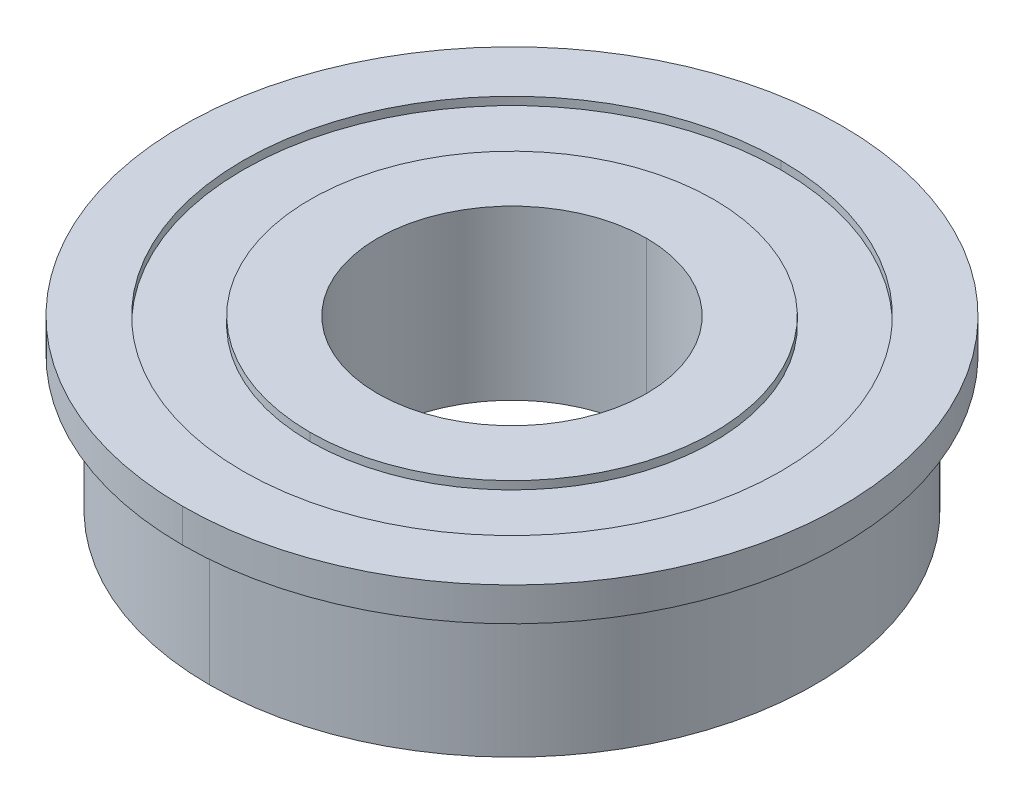
ISO-10303-21;
HEADER;
FILE_DESCRIPTION(('STEP AP214'),'2;1');
FILE_NAME('part.step','',(''),(''),'','','');
FILE_SCHEMA(('AUTOMOTIVE_DESIGN { 1 0 10303 214 1 1 1 1 }'));
ENDSEC;
DATA;
#1=APPLICATION_CONTEXT('core data for automotive mechanical design processes');
#2=APPLICATION_PROTOCOL_DEFINITION('international standard','automotive_design',2000,#1);
#3=PRODUCT_CONTEXT('',#1,'mechanical');
#4=PRODUCT('Part','Part','',(#3));
#5=PRODUCT_RELATED_PRODUCT_CATEGORY('part','',(#4));
#6=PRODUCT_DEFINITION_FORMATION('','',#4);
#7=PRODUCT_DEFINITION_CONTEXT('part definition',#1,'design');
#8=PRODUCT_DEFINITION('design','',#6,#7);
#9=PRODUCT_DEFINITION_SHAPE('','',#8);
#10=(LENGTH_UNIT() NAMED_UNIT(*) SI_UNIT(.MILLI.,.METRE.));
#11=(NAMED_UNIT(*) PLANE_ANGLE_UNIT() SI_UNIT($,.RADIAN.));
#12=(NAMED_UNIT(*) SI_UNIT($,.STERADIAN.) SOLID_ANGLE_UNIT());
#13=UNCERTAINTY_MEASURE_WITH_UNIT(LENGTH_MEASURE(1.E-05),#10,'distance_accuracy_value','');
#14=(GEOMETRIC_REPRESENTATION_CONTEXT(3) GLOBAL_UNCERTAINTY_ASSIGNED_CONTEXT((#13)) GLOBAL_UNIT_ASSIGNED_CONTEXT((#10,
#11,#12)) REPRESENTATION_CONTEXT('',''));
#15=CARTESIAN_POINT('',(0.,0.,0.));
#16=DIRECTION('',(0.,0.,1.));
#17=DIRECTION('',(1.,0.,0.));
#18=AXIS2_PLACEMENT_3D('',#15,#16,#17);
#19=CARTESIAN_POINT('',(0.,0.,0.));
#20=DIRECTION('',(0.,1.,0.));
#21=DIRECTION('',(0.,0.,1.));
#22=AXIS2_PLACEMENT_3D('',#19,#20,#21);
#23=CYLINDRICAL_SURFACE('',#22,12.7);
#24=CARTESIAN_POINT('',(0.,7.5565,0.));
#25=DIRECTION('',(0.,1.,0.));
#26=DIRECTION('',(0.,0.,1.));
#27=AXIS2_PLACEMENT_3D('',#24,#25,#26);
#28=CIRCLE('',#27,12.7);
#29=CARTESIAN_POINT('',(0.,7.5565,-12.7));
#30=VERTEX_POINT('',#29);
#31=CARTESIAN_POINT('',(0.,7.5565,12.7));
#32=VERTEX_POINT('',#31);
#33=EDGE_CURVE('E41',#30,#32,#28,.T.);
#34=ORIENTED_EDGE('',*,*,#33,.F.);
#35=DIRECTION('',(0.,1.,0.));
#36=VECTOR('',#35,1.);
#37=CARTESIAN_POINT('',(0.,0.,-12.7));
#38=LINE('',#37,#36);
#39=CARTESIAN_POINT('',(0.,7.9375,-12.7));
#40=VERTEX_POINT('',#39);
#41=EDGE_CURVE('E11',#30,#40,#38,.T.);
#42=ORIENTED_EDGE('',*,*,#41,.T.);
#43=CARTESIAN_POINT('',(0.,7.9375,0.));
#44=DIRECTION('',(0.,1.,0.));
#45=DIRECTION('',(0.,0.,1.));
#46=AXIS2_PLACEMENT_3D('',#43,#44,#45);
#47=CIRCLE('',#46,12.7);
#48=CARTESIAN_POINT('',(0.,7.9375,12.7));
#49=VERTEX_POINT('',#48);
#50=EDGE_CURVE('E27',#40,#49,#47,.T.);
#51=ORIENTED_EDGE('',*,*,#50,.T.);
#52=DIRECTION('',(0.,1.,0.));
#53=VECTOR('',#52,1.);
#54=CARTESIAN_POINT('',(0.,0.,12.7));
#55=LINE('',#54,#53);
#56=EDGE_CURVE('E175',#32,#49,#55,.T.);
#57=ORIENTED_EDGE('',*,*,#56,.F.);
#58=EDGE_LOOP('',(#34,#42,#51,#57));
#59=FACE_BOUND('',#58,.T.);
#60=ADVANCED_FACE('F16',(#59),#23,.F.);
#61=CARTESIAN_POINT('',(0.,0.,0.));
#62=DIRECTION('',(0.,1.,0.));
#63=DIRECTION('',(0.,0.,1.));
#64=AXIS2_PLACEMENT_3D('',#61,#62,#63);
#65=CYLINDRICAL_SURFACE('',#64,15.5575);
#66=CARTESIAN_POINT('',(0.,6.35,0.));
#67=DIRECTION('',(0.,1.,0.));
#68=DIRECTION('',(0.,0.,1.));
#69=AXIS2_PLACEMENT_3D('',#66,#67,#68);
#70=CIRCLE('',#69,15.5575);
#71=CARTESIAN_POINT('',(0.,6.35,15.5575));
#72=VERTEX_POINT('',#71);
#73=CARTESIAN_POINT('',(0.,6.35,-15.5575));
#74=VERTEX_POINT('',#73);
#75=EDGE_CURVE('E136',#72,#74,#70,.T.);
#76=ORIENTED_EDGE('',*,*,#75,.T.);
#77=DIRECTION('',(0.,1.,0.));
#78=VECTOR('',#77,1.);
#79=CARTESIAN_POINT('',(0.,0.,-15.5575));
#80=LINE('',#79,#78);
#81=CARTESIAN_POINT('',(0.,7.9375,-15.5575));
#82=VERTEX_POINT('',#81);
#83=EDGE_CURVE('E134',#74,#82,#80,.T.);
#84=ORIENTED_EDGE('',*,*,#83,.T.);
#85=CARTESIAN_POINT('',(0.,7.9375,0.));
#86=DIRECTION('',(0.,1.,0.));
#87=DIRECTION('',(0.,0.,1.));
#88=AXIS2_PLACEMENT_3D('',#85,#86,#87);
#89=CIRCLE('',#88,15.5575);
#90=CARTESIAN_POINT('',(0.,7.9375,15.5575));
#91=VERTEX_POINT('',#90);
#92=EDGE_CURVE('E206',#91,#82,#89,.T.);
#93=ORIENTED_EDGE('',*,*,#92,.F.);
#94=DIRECTION('',(0.,1.,0.));
#95=VECTOR('',#94,1.);
#96=CARTESIAN_POINT('',(0.,0.,15.5575));
#97=LINE('',#96,#95);
#98=EDGE_CURVE('E200',#72,#91,#97,.T.);
#99=ORIENTED_EDGE('',*,*,#98,.F.);
#100=EDGE_LOOP('',(#76,#84,#93,#99));
#101=FACE_BOUND('',#100,.T.);
#102=ADVANCED_FACE('F257',(#101),#65,.T.);
#103=CARTESIAN_POINT('',(0.,0.,0.));
#104=DIRECTION('',(0.,1.,0.));
#105=DIRECTION('',(0.,0.,1.));
#106=AXIS2_PLACEMENT_3D('',#103,#104,#105);
#107=CYLINDRICAL_SURFACE('',#106,14.2875);
#108=CARTESIAN_POINT('',(0.,0.,0.));
#109=DIRECTION('',(0.,1.,0.));
#110=DIRECTION('',(0.,0.,1.));
#111=AXIS2_PLACEMENT_3D('',#108,#109,#110);
#112=CIRCLE('',#111,14.2875);
#113=CARTESIAN_POINT('',(0.,0.,14.2875));
#114=VERTEX_POINT('',#113);
#115=CARTESIAN_POINT('',(0.,0.,-14.2875));
#116=VERTEX_POINT('',#115);
#117=EDGE_CURVE('E137',#114,#116,#112,.T.);
#118=ORIENTED_EDGE('',*,*,#117,.T.);
#119=DIRECTION('',(0.,1.,0.));
#120=VECTOR('',#119,1.);
#121=CARTESIAN_POINT('',(0.,0.,-14.2875));
#122=LINE('',#121,#120);
#123=CARTESIAN_POINT('',(0.,6.35,-14.2875));
#124=VERTEX_POINT('',#123);
#125=EDGE_CURVE('E20',#116,#124,#122,.T.);
#126=ORIENTED_EDGE('',*,*,#125,.T.);
#127=CARTESIAN_POINT('',(0.,6.35,0.));
#128=DIRECTION('',(0.,1.,0.));
#129=DIRECTION('',(0.,0.,1.));
#130=AXIS2_PLACEMENT_3D('',#127,#128,#129);
#131=CIRCLE('',#130,14.2875);
#132=CARTESIAN_POINT('',(0.,6.35,14.2875));
#133=VERTEX_POINT('',#132);
#134=EDGE_CURVE('E143',#133,#124,#131,.T.);
#135=ORIENTED_EDGE('',*,*,#134,.F.);
#136=DIRECTION('',(0.,1.,0.));
#137=VECTOR('',#136,1.);
#138=CARTESIAN_POINT('',(0.,0.,14.2875));
#139=LINE('',#138,#137);
#140=EDGE_CURVE('E139',#114,#133,#139,.T.);
#141=ORIENTED_EDGE('',*,*,#140,.F.);
#142=EDGE_LOOP('',(#118,#126,#135,#141));
#143=FACE_BOUND('',#142,.T.);
#144=ADVANCED_FACE('F233',(#143),#107,.T.);
#145=CARTESIAN_POINT('',(0.,0.,0.));
#146=DIRECTION('',(0.,1.,0.));
#147=DIRECTION('',(0.,0.,1.));
#148=AXIS2_PLACEMENT_3D('',#145,#146,#147);
#149=CYLINDRICAL_SURFACE('',#148,6.35);
#150=CARTESIAN_POINT('',(0.,0.,0.));
#151=DIRECTION('',(0.,1.,0.));
#152=DIRECTION('',(0.,0.,1.));
#153=AXIS2_PLACEMENT_3D('',#150,#151,#152);
#154=CIRCLE('',#153,6.35);
#155=CARTESIAN_POINT('',(0.,0.,-6.35));
#156=VERTEX_POINT('',#155);
#157=CARTESIAN_POINT('',(0.,0.,6.35));
#158=VERTEX_POINT('',#157);
#159=EDGE_CURVE('E102',#156,#158,#154,.T.);
#160=ORIENTED_EDGE('',*,*,#159,.F.);
#161=DIRECTION('',(0.,1.,0.));
#162=VECTOR('',#161,1.);
#163=CARTESIAN_POINT('',(0.,0.,-6.35));
#164=LINE('',#163,#162);
#165=CARTESIAN_POINT('',(0.,7.9375,-6.35));
#166=VERTEX_POINT('',#165);
#167=EDGE_CURVE('E124',#156,#166,#164,.T.);
#168=ORIENTED_EDGE('',*,*,#167,.T.);
#169=CARTESIAN_POINT('',(0.,7.9375,0.));
#170=DIRECTION('',(0.,1.,0.));
#171=DIRECTION('',(0.,0.,1.));
#172=AXIS2_PLACEMENT_3D('',#169,#170,#171);
#173=CIRCLE('',#172,6.35);
#174=CARTESIAN_POINT('',(0.,7.9375,6.35));
#175=VERTEX_POINT('',#174);
#176=EDGE_CURVE('E115',#166,#175,#173,.T.);
#177=ORIENTED_EDGE('',*,*,#176,.T.);
#178=DIRECTION('',(0.,1.,0.));
#179=VECTOR('',#178,1.);
#180=CARTESIAN_POINT('',(0.,0.,6.35));
#181=LINE('',#180,#179);
#182=EDGE_CURVE('E114',#158,#175,#181,.T.);
#183=ORIENTED_EDGE('',*,*,#182,.F.);
#184=EDGE_LOOP('',(#160,#168,#177,#183));
#185=FACE_BOUND('',#184,.T.);
#186=ADVANCED_FACE('F18',(#185),#149,.F.);
#187=CARTESIAN_POINT('',(0.,0.,0.));
#188=DIRECTION('',(0.,1.,0.));
#189=DIRECTION('',(0.,0.,1.));
#190=AXIS2_PLACEMENT_3D('',#187,#188,#189);
#191=CYLINDRICAL_SURFACE('',#190,9.525);
#192=CARTESIAN_POINT('',(0.,7.5565,0.));
#193=DIRECTION('',(0.,1.,0.));
#194=DIRECTION('',(0.,0.,1.));
#195=AXIS2_PLACEMENT_3D('',#192,#193,#194);
#196=CIRCLE('',#195,9.525);
#197=CARTESIAN_POINT('',(0.,7.5565,9.525));
#198=VERTEX_POINT('',#197);
#199=CARTESIAN_POINT('',(0.,7.5565,-9.525));
#200=VERTEX_POINT('',#199);
#201=EDGE_CURVE('E159',#198,#200,#196,.T.);
#202=ORIENTED_EDGE('',*,*,#201,.T.);
#203=DIRECTION('',(0.,1.,0.));
#204=VECTOR('',#203,1.);
#205=CARTESIAN_POINT('',(0.,0.,-9.525));
#206=LINE('',#205,#204);
#207=CARTESIAN_POINT('',(0.,7.9375,-9.525));
#208=VERTEX_POINT('',#207);
#209=EDGE_CURVE('E163',#200,#208,#206,.T.);
#210=ORIENTED_EDGE('',*,*,#209,.T.);
#211=CARTESIAN_POINT('',(0.,7.9375,0.));
#212=DIRECTION('',(0.,1.,0.));
#213=DIRECTION('',(0.,0.,1.));
#214=AXIS2_PLACEMENT_3D('',#211,#212,#213);
#215=CIRCLE('',#214,9.525);
#216=CARTESIAN_POINT('',(0.,7.9375,9.525));
#217=VERTEX_POINT('',#216);
#218=EDGE_CURVE('E147',#217,#208,#215,.T.);
#219=ORIENTED_EDGE('',*,*,#218,.F.);
#220=DIRECTION('',(0.,1.,0.));
#221=VECTOR('',#220,1.);
#222=CARTESIAN_POINT('',(0.,0.,9.525));
#223=LINE('',#222,#221);
#224=EDGE_CURVE('E168',#198,#217,#223,.T.);
#225=ORIENTED_EDGE('',*,*,#224,.F.);
#226=EDGE_LOOP('',(#202,#210,#219,#225));
#227=FACE_BOUND('',#226,.T.);
#228=ADVANCED_FACE('F266',(#227),#191,.T.);
#229=CARTESIAN_POINT('',(0.,0.,0.));
#230=DIRECTION('',(0.,1.,0.));
#231=DIRECTION('',(0.,0.,1.));
#232=AXIS2_PLACEMENT_3D('',#229,#230,#231);
#233=CYLINDRICAL_SURFACE('',#232,9.525);
#234=ORIENTED_EDGE('',*,*,#209,.F.);
#235=CARTESIAN_POINT('',(0.,7.5565,0.));
#236=DIRECTION('',(0.,1.,0.));
#237=DIRECTION('',(0.,0.,1.));
#238=AXIS2_PLACEMENT_3D('',#235,#236,#237);
#239=CIRCLE('',#238,9.525);
#240=EDGE_CURVE('E164',#200,#198,#239,.T.);
#241=ORIENTED_EDGE('',*,*,#240,.T.);
#242=ORIENTED_EDGE('',*,*,#224,.T.);
#243=CARTESIAN_POINT('',(0.,7.9375,0.));
#244=DIRECTION('',(0.,1.,0.));
#245=DIRECTION('',(0.,0.,1.));
#246=AXIS2_PLACEMENT_3D('',#243,#244,#245);
#247=CIRCLE('',#246,9.525);
#248=EDGE_CURVE('E120',#208,#217,#247,.T.);
#249=ORIENTED_EDGE('',*,*,#248,.F.);
#250=EDGE_LOOP('',(#234,#241,#242,#249));
#251=FACE_BOUND('',#250,.T.);
#252=ADVANCED_FACE('F269',(#251),#233,.T.);
#253=CARTESIAN_POINT('',(6.35,7.9375,0.));
#254=DIRECTION('',(0.,1.,0.));
#255=DIRECTION('',(1.,0.,0.));
#256=AXIS2_PLACEMENT_3D('',#253,#254,#255);
#257=PLANE('',#256);
#258=ORIENTED_EDGE('',*,*,#218,.T.);
#259=ORIENTED_EDGE('',*,*,#248,.T.);
#260=EDGE_LOOP('',(#258,#259));
#261=FACE_BOUND('',#260,.T.);
#262=CARTESIAN_POINT('',(0.,7.9375,0.));
#263=DIRECTION('',(0.,1.,0.));
#264=DIRECTION('',(0.,0.,1.));
#265=AXIS2_PLACEMENT_3D('',#262,#263,#264);
#266=CIRCLE('',#265,6.35);
#267=EDGE_CURVE('E121',#175,#166,#266,.T.);
#268=ORIENTED_EDGE('',*,*,#267,.F.);
#269=ORIENTED_EDGE('',*,*,#176,.F.);
#270=EDGE_LOOP('',(#268,#269));
#271=FACE_BOUND('',#270,.T.);
#272=ADVANCED_FACE('F277',(#261,#271),#257,.T.);
#273=CARTESIAN_POINT('',(0.,0.,0.));
#274=DIRECTION('',(0.,1.,0.));
#275=DIRECTION('',(0.,0.,1.));
#276=AXIS2_PLACEMENT_3D('',#273,#274,#275);
#277=CYLINDRICAL_SURFACE('',#276,6.35);
#278=ORIENTED_EDGE('',*,*,#167,.F.);
#279=CARTESIAN_POINT('',(0.,0.,0.));
#280=DIRECTION('',(0.,1.,0.));
#281=DIRECTION('',(0.,0.,1.));
#282=AXIS2_PLACEMENT_3D('',#279,#280,#281);
#283=CIRCLE('',#282,6.35);
#284=EDGE_CURVE('E106',#158,#156,#283,.T.);
#285=ORIENTED_EDGE('',*,*,#284,.F.);
#286=ORIENTED_EDGE('',*,*,#182,.T.);
#287=ORIENTED_EDGE('',*,*,#267,.T.);
#288=EDGE_LOOP('',(#278,#285,#286,#287));
#289=FACE_BOUND('',#288,.T.);
#290=ADVANCED_FACE('F123',(#289),#277,.F.);
#291=CARTESIAN_POINT('',(14.2875,0.,0.));
#292=DIRECTION('',(0.,-1.,0.));
#293=DIRECTION('',(0.,0.,-1.));
#294=AXIS2_PLACEMENT_3D('',#291,#292,#293);
#295=PLANE('',#294);
#296=ORIENTED_EDGE('',*,*,#117,.F.);
#297=CARTESIAN_POINT('',(0.,0.,0.));
#298=DIRECTION('',(0.,1.,0.));
#299=DIRECTION('',(0.,0.,1.));
#300=AXIS2_PLACEMENT_3D('',#297,#298,#299);
#301=CIRCLE('',#300,14.2875);
#302=EDGE_CURVE('E111',#116,#114,#301,.T.);
#303=ORIENTED_EDGE('',*,*,#302,.F.);
#304=EDGE_LOOP('',(#296,#303));
#305=FACE_BOUND('',#304,.T.);
#306=ORIENTED_EDGE('',*,*,#284,.T.);
#307=ORIENTED_EDGE('',*,*,#159,.T.);
#308=EDGE_LOOP('',(#306,#307));
#309=FACE_BOUND('',#308,.T.);
#310=ADVANCED_FACE('F104',(#305,#309),#295,.T.);
#311=CARTESIAN_POINT('',(0.,0.,0.));
#312=DIRECTION('',(0.,1.,0.));
#313=DIRECTION('',(0.,0.,1.));
#314=AXIS2_PLACEMENT_3D('',#311,#312,#313);
#315=CYLINDRICAL_SURFACE('',#314,14.2875);
#316=ORIENTED_EDGE('',*,*,#125,.F.);
#317=ORIENTED_EDGE('',*,*,#302,.T.);
#318=ORIENTED_EDGE('',*,*,#140,.T.);
#319=CARTESIAN_POINT('',(0.,6.35,0.));
#320=DIRECTION('',(0.,1.,0.));
#321=DIRECTION('',(0.,0.,1.));
#322=AXIS2_PLACEMENT_3D('',#319,#320,#321);
#323=CIRCLE('',#322,14.2875);
#324=EDGE_CURVE('E170',#124,#133,#323,.T.);
#325=ORIENTED_EDGE('',*,*,#324,.F.);
#326=EDGE_LOOP('',(#316,#317,#318,#325));
#327=FACE_BOUND('',#326,.T.);
#328=ADVANCED_FACE('F238',(#327),#315,.T.);
#329=CARTESIAN_POINT('',(15.5575,6.35,0.));
#330=DIRECTION('',(0.,-1.,0.));
#331=DIRECTION('',(0.,0.,-1.));
#332=AXIS2_PLACEMENT_3D('',#329,#330,#331);
#333=PLANE('',#332);
#334=ORIENTED_EDGE('',*,*,#75,.F.);
#335=CARTESIAN_POINT('',(0.,6.35,0.));
#336=DIRECTION('',(0.,1.,0.));
#337=DIRECTION('',(0.,0.,1.));
#338=AXIS2_PLACEMENT_3D('',#335,#336,#337);
#339=CIRCLE('',#338,15.5575);
#340=EDGE_CURVE('E217',#74,#72,#339,.T.);
#341=ORIENTED_EDGE('',*,*,#340,.F.);
#342=EDGE_LOOP('',(#334,#341));
#343=FACE_BOUND('',#342,.T.);
#344=ORIENTED_EDGE('',*,*,#134,.T.);
#345=ORIENTED_EDGE('',*,*,#324,.T.);
#346=EDGE_LOOP('',(#344,#345));
#347=FACE_BOUND('',#346,.T.);
#348=ADVANCED_FACE('F240',(#343,#347),#333,.T.);
#349=CARTESIAN_POINT('',(0.,0.,0.));
#350=DIRECTION('',(0.,1.,0.));
#351=DIRECTION('',(0.,0.,1.));
#352=AXIS2_PLACEMENT_3D('',#349,#350,#351);
#353=CYLINDRICAL_SURFACE('',#352,15.5575);
#354=ORIENTED_EDGE('',*,*,#83,.F.);
#355=ORIENTED_EDGE('',*,*,#340,.T.);
#356=ORIENTED_EDGE('',*,*,#98,.T.);
#357=CARTESIAN_POINT('',(0.,7.9375,0.));
#358=DIRECTION('',(0.,1.,0.));
#359=DIRECTION('',(0.,0.,1.));
#360=AXIS2_PLACEMENT_3D('',#357,#358,#359);
#361=CIRCLE('',#360,15.5575);
#362=EDGE_CURVE('E177',#82,#91,#361,.T.);
#363=ORIENTED_EDGE('',*,*,#362,.F.);
#364=EDGE_LOOP('',(#354,#355,#356,#363));
#365=FACE_BOUND('',#364,.T.);
#366=ADVANCED_FACE('F242',(#365),#353,.T.);
#367=CARTESIAN_POINT('',(12.7,7.9375,0.));
#368=DIRECTION('',(0.,1.,0.));
#369=DIRECTION('',(1.,0.,0.));
#370=AXIS2_PLACEMENT_3D('',#367,#368,#369);
#371=PLANE('',#370);
#372=ORIENTED_EDGE('',*,*,#92,.T.);
#373=ORIENTED_EDGE('',*,*,#362,.T.);
#374=EDGE_LOOP('',(#372,#373));
#375=FACE_BOUND('',#374,.T.);
#376=CARTESIAN_POINT('',(0.,7.9375,0.));
#377=DIRECTION('',(0.,1.,0.));
#378=DIRECTION('',(0.,0.,1.));
#379=AXIS2_PLACEMENT_3D('',#376,#377,#378);
#380=CIRCLE('',#379,12.7);
#381=EDGE_CURVE('E178',#49,#40,#380,.T.);
#382=ORIENTED_EDGE('',*,*,#381,.F.);
#383=ORIENTED_EDGE('',*,*,#50,.F.);
#384=EDGE_LOOP('',(#382,#383));
#385=FACE_BOUND('',#384,.T.);
#386=ADVANCED_FACE('F250',(#375,#385),#371,.T.);
#387=CARTESIAN_POINT('',(0.,0.,0.));
#388=DIRECTION('',(0.,1.,0.));
#389=DIRECTION('',(0.,0.,1.));
#390=AXIS2_PLACEMENT_3D('',#387,#388,#389);
#391=CYLINDRICAL_SURFACE('',#390,12.7);
#392=ORIENTED_EDGE('',*,*,#41,.F.);
#393=CARTESIAN_POINT('',(0.,7.5565,0.));
#394=DIRECTION('',(0.,1.,0.));
#395=DIRECTION('',(0.,0.,1.));
#396=AXIS2_PLACEMENT_3D('',#393,#394,#395);
#397=CIRCLE('',#396,12.7);
#398=EDGE_CURVE('E150',#32,#30,#397,.T.);
#399=ORIENTED_EDGE('',*,*,#398,.F.);
#400=ORIENTED_EDGE('',*,*,#56,.T.);
#401=ORIENTED_EDGE('',*,*,#381,.T.);
#402=EDGE_LOOP('',(#392,#399,#400,#401));
#403=FACE_BOUND('',#402,.T.);
#404=ADVANCED_FACE('F274',(#403),#391,.F.);
#405=CARTESIAN_POINT('',(9.525,7.5565,0.));
#406=DIRECTION('',(0.,1.,0.));
#407=DIRECTION('',(1.,0.,0.));
#408=AXIS2_PLACEMENT_3D('',#405,#406,#407);
#409=PLANE('',#408);
#410=ORIENTED_EDGE('',*,*,#398,.T.);
#411=ORIENTED_EDGE('',*,*,#33,.T.);
#412=EDGE_LOOP('',(#410,#411));
#413=FACE_BOUND('',#412,.T.);
#414=ORIENTED_EDGE('',*,*,#201,.F.);
#415=ORIENTED_EDGE('',*,*,#240,.F.);
#416=EDGE_LOOP('',(#414,#415));
#417=FACE_BOUND('',#416,.T.);
#418=ADVANCED_FACE('F271',(#413,#417),#409,.T.);
#419=CLOSED_SHELL('',(#60,#102,#144,#186,#228,#252,#272,#290,#310,#328,#348,#366,#386,#404,#418));
#420=MANIFOLD_SOLID_BREP('B1',#419);
#421=ADVANCED_BREP_SHAPE_REPRESENTATION('',(#18,#420),#14);
#422=SHAPE_DEFINITION_REPRESENTATION(#9,#421);
ENDSEC;
END-ISO-10303-21;
